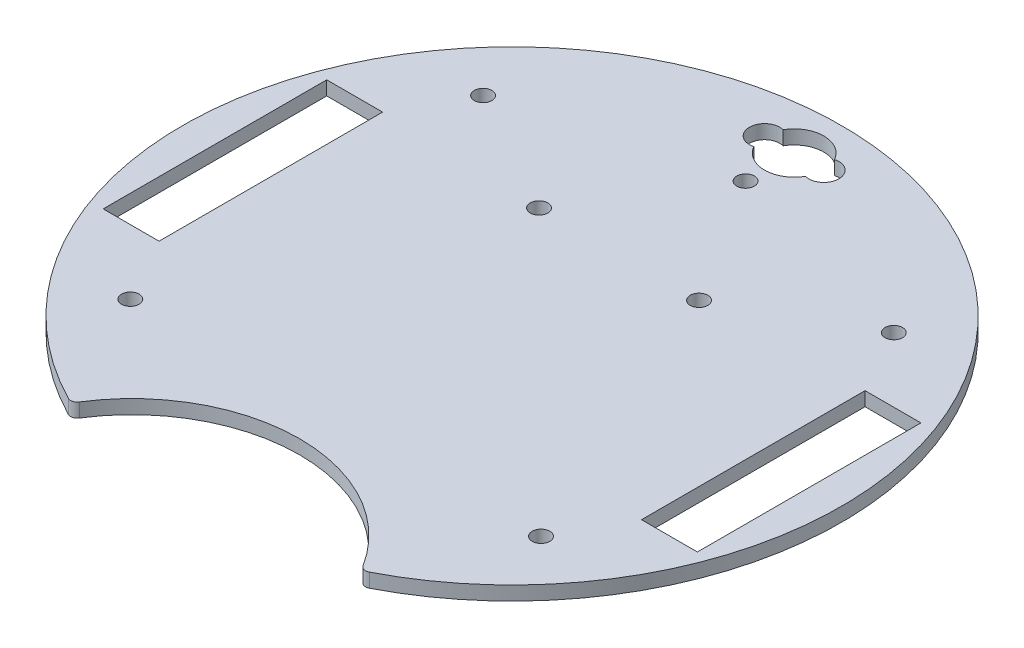
ISO-10303-21;
HEADER;
FILE_DESCRIPTION(('STEP AP214'),'2;1');
FILE_NAME('part.step','',(''),(''),'','','');
FILE_SCHEMA(('AUTOMOTIVE_DESIGN { 1 0 10303 214 1 1 1 1 }'));
ENDSEC;
DATA;
#1=APPLICATION_CONTEXT('core data for automotive mechanical design processes');
#2=APPLICATION_PROTOCOL_DEFINITION('international standard','automotive_design',2000,#1);
#3=PRODUCT_CONTEXT('',#1,'mechanical');
#4=PRODUCT('Part','Part','',(#3));
#5=PRODUCT_RELATED_PRODUCT_CATEGORY('part','',(#4));
#6=PRODUCT_DEFINITION_FORMATION('','',#4);
#7=PRODUCT_DEFINITION_CONTEXT('part definition',#1,'design');
#8=PRODUCT_DEFINITION('design','',#6,#7);
#9=PRODUCT_DEFINITION_SHAPE('','',#8);
#10=(LENGTH_UNIT() NAMED_UNIT(*) SI_UNIT(.MILLI.,.METRE.));
#11=(NAMED_UNIT(*) PLANE_ANGLE_UNIT() SI_UNIT($,.RADIAN.));
#12=(NAMED_UNIT(*) SI_UNIT($,.STERADIAN.) SOLID_ANGLE_UNIT());
#13=UNCERTAINTY_MEASURE_WITH_UNIT(LENGTH_MEASURE(1.E-05),#10,'distance_accuracy_value','');
#14=(GEOMETRIC_REPRESENTATION_CONTEXT(3) GLOBAL_UNCERTAINTY_ASSIGNED_CONTEXT((#13)) GLOBAL_UNIT_ASSIGNED_CONTEXT((#10,
#11,#12)) REPRESENTATION_CONTEXT('',''));
#15=CARTESIAN_POINT('',(0.,0.,0.));
#16=DIRECTION('',(0.,0.,1.));
#17=DIRECTION('',(1.,0.,0.));
#18=AXIS2_PLACEMENT_3D('',#15,#16,#17);
#19=CARTESIAN_POINT('',(0.,3.175,-64.1076988434385));
#20=DIRECTION('',(0.,-1.,0.));
#21=DIRECTION('',(0.,0.,-1.));
#22=AXIS2_PLACEMENT_3D('',#19,#20,#21);
#23=CYLINDRICAL_SURFACE('',#22,6.731);
#24=CARTESIAN_POINT('',(0.,0.,-64.1076988434385));
#25=DIRECTION('',(0.,1.,0.));
#26=DIRECTION('',(0.,0.,1.));
#27=AXIS2_PLACEMENT_3D('',#24,#25,#26);
#28=CIRCLE('',#27,6.731);
#29=CARTESIAN_POINT('',(-5.85389998799957,0.,-60.7853177800295));
#30=VERTEX_POINT('',#29);
#31=CARTESIAN_POINT('',(5.85757547169812,0.,-60.7918021934567));
#32=VERTEX_POINT('',#31);
#33=EDGE_CURVE('E235',#30,#32,#28,.T.);
#34=ORIENTED_EDGE('',*,*,#33,.F.);
#35=DIRECTION('',(0.,-1.,0.));
#36=VECTOR('',#35,1.);
#37=CARTESIAN_POINT('',(-5.85389998799957,3.175,-60.7853177800295));
#38=LINE('',#37,#36);
#39=CARTESIAN_POINT('',(-5.85389998799957,3.175,-60.7853177800295));
#40=VERTEX_POINT('',#39);
#41=EDGE_CURVE('E11',#40,#30,#38,.T.);
#42=ORIENTED_EDGE('',*,*,#41,.F.);
#43=CARTESIAN_POINT('',(0.,3.175,-64.1076988434385));
#44=DIRECTION('',(0.,1.,0.));
#45=DIRECTION('',(0.,0.,1.));
#46=AXIS2_PLACEMENT_3D('',#43,#44,#45);
#47=CIRCLE('',#46,6.731);
#48=CARTESIAN_POINT('',(5.85757547169812,3.175,-60.7918021934567));
#49=VERTEX_POINT('',#48);
#50=EDGE_CURVE('E170',#40,#49,#47,.T.);
#51=ORIENTED_EDGE('',*,*,#50,.T.);
#52=DIRECTION('',(0.,-1.,0.));
#53=VECTOR('',#52,1.);
#54=CARTESIAN_POINT('',(5.85757547169812,3.175,-60.7918021934567));
#55=LINE('',#54,#53);
#56=EDGE_CURVE('E53',#49,#32,#55,.T.);
#57=ORIENTED_EDGE('',*,*,#56,.T.);
#58=EDGE_LOOP('',(#34,#42,#51,#57));
#59=FACE_BOUND('',#58,.T.);
#60=ADVANCED_FACE('F34',(#59),#23,.F.);
#61=CARTESIAN_POINT('',(-6.731,3.175,-64.1076988434385));
#62=DIRECTION('',(0.,-1.,0.));
#63=DIRECTION('',(0.,0.,-1.));
#64=AXIS2_PLACEMENT_3D('',#61,#62,#63);
#65=CYLINDRICAL_SURFACE('',#64,3.43620726405579);
#66=CARTESIAN_POINT('',(-6.731,0.,-64.1076988434385));
#67=DIRECTION('',(0.,1.,0.));
#68=DIRECTION('',(0.,0.,1.));
#69=AXIS2_PLACEMENT_3D('',#66,#67,#68);
#70=CIRCLE('',#69,3.43620726405579);
#71=CARTESIAN_POINT('',(-5.85389998799957,0.,-67.4300799068475));
#72=VERTEX_POINT('',#71);
#73=EDGE_CURVE('E158',#72,#30,#70,.T.);
#74=ORIENTED_EDGE('',*,*,#73,.F.);
#75=DIRECTION('',(0.,-1.,0.));
#76=VECTOR('',#75,1.);
#77=CARTESIAN_POINT('',(-5.85389998799957,3.175,-67.4300799068475));
#78=LINE('',#77,#76);
#79=CARTESIAN_POINT('',(-5.85389998799957,3.175,-67.4300799068475));
#80=VERTEX_POINT('',#79);
#81=EDGE_CURVE('E44',#80,#72,#78,.T.);
#82=ORIENTED_EDGE('',*,*,#81,.F.);
#83=CARTESIAN_POINT('',(-6.731,3.175,-64.1076988434385));
#84=DIRECTION('',(0.,1.,0.));
#85=DIRECTION('',(0.,0.,1.));
#86=AXIS2_PLACEMENT_3D('',#83,#84,#85);
#87=CIRCLE('',#86,3.43620726405579);
#88=EDGE_CURVE('E156',#80,#40,#87,.T.);
#89=ORIENTED_EDGE('',*,*,#88,.T.);
#90=ORIENTED_EDGE('',*,*,#41,.T.);
#91=EDGE_LOOP('',(#74,#82,#89,#90));
#92=FACE_BOUND('',#91,.T.);
#93=ADVANCED_FACE('F155',(#92),#65,.F.);
#94=CARTESIAN_POINT('',(0.,3.175,-64.1076988434385));
#95=DIRECTION('',(0.,-1.,0.));
#96=DIRECTION('',(0.,0.,-1.));
#97=AXIS2_PLACEMENT_3D('',#94,#95,#96);
#98=CYLINDRICAL_SURFACE('',#97,6.731);
#99=CARTESIAN_POINT('',(0.,0.,-64.1076988434385));
#100=DIRECTION('',(0.,1.,0.));
#101=DIRECTION('',(0.,0.,1.));
#102=AXIS2_PLACEMENT_3D('',#99,#100,#101);
#103=CIRCLE('',#102,6.731);
#104=CARTESIAN_POINT('',(5.8575754716981,0.,-67.4235954934203));
#105=VERTEX_POINT('',#104);
#106=EDGE_CURVE('E238',#105,#72,#103,.T.);
#107=ORIENTED_EDGE('',*,*,#106,.F.);
#108=DIRECTION('',(0.,-1.,0.));
#109=VECTOR('',#108,1.);
#110=CARTESIAN_POINT('',(5.8575754716981,3.175,-67.4235954934203));
#111=LINE('',#110,#109);
#112=CARTESIAN_POINT('',(5.8575754716981,3.175,-67.4235954934203));
#113=VERTEX_POINT('',#112);
#114=EDGE_CURVE('E102',#113,#105,#111,.T.);
#115=ORIENTED_EDGE('',*,*,#114,.F.);
#116=CARTESIAN_POINT('',(0.,3.175,-64.1076988434385));
#117=DIRECTION('',(0.,1.,0.));
#118=DIRECTION('',(0.,0.,1.));
#119=AXIS2_PLACEMENT_3D('',#116,#117,#118);
#120=CIRCLE('',#119,6.731);
#121=EDGE_CURVE('E169',#113,#80,#120,.T.);
#122=ORIENTED_EDGE('',*,*,#121,.T.);
#123=ORIENTED_EDGE('',*,*,#81,.T.);
#124=EDGE_LOOP('',(#107,#115,#122,#123));
#125=FACE_BOUND('',#124,.T.);
#126=ADVANCED_FACE('F172',(#125),#98,.F.);
#127=CARTESIAN_POINT('',(0.,3.175,-25.4000000000001));
#128=DIRECTION('',(0.,0.,-1.));
#129=DIRECTION('',(-1.,0.,0.));
#130=AXIS2_PLACEMENT_3D('',#127,#128,#129);
#131=PLANE('',#130);
#132=DIRECTION('',(1.,0.,0.));
#133=VECTOR('',#132,1.);
#134=CARTESIAN_POINT('',(0.,0.,-25.4000000000001));
#135=LINE('',#134,#133);
#136=CARTESIAN_POINT('',(-67.5141237268841,0.,-25.4000000000001));
#137=VERTEX_POINT('',#136);
#138=CARTESIAN_POINT('',(-54.8141237268841,0.,-25.4000000000001));
#139=VERTEX_POINT('',#138);
#140=EDGE_CURVE('E224',#137,#139,#135,.T.);
#141=ORIENTED_EDGE('',*,*,#140,.T.);
#142=DIRECTION('',(0.,-1.,0.));
#143=VECTOR('',#142,1.);
#144=CARTESIAN_POINT('',(-54.8141237268841,3.175,-25.4000000000001));
#145=LINE('',#144,#143);
#146=CARTESIAN_POINT('',(-54.8141237268841,3.175,-25.4000000000001));
#147=VERTEX_POINT('',#146);
#148=EDGE_CURVE('E251',#147,#139,#145,.T.);
#149=ORIENTED_EDGE('',*,*,#148,.F.);
#150=DIRECTION('',(1.,0.,0.));
#151=VECTOR('',#150,1.);
#152=CARTESIAN_POINT('',(0.,3.175,-25.4000000000001));
#153=LINE('',#152,#151);
#154=CARTESIAN_POINT('',(-67.5141237268841,3.175,-25.4000000000001));
#155=VERTEX_POINT('',#154);
#156=EDGE_CURVE('E559',#155,#147,#153,.T.);
#157=ORIENTED_EDGE('',*,*,#156,.F.);
#158=DIRECTION('',(0.,-1.,0.));
#159=VECTOR('',#158,1.);
#160=CARTESIAN_POINT('',(-67.5141237268841,3.175,-25.4000000000001));
#161=LINE('',#160,#159);
#162=EDGE_CURVE('E253',#155,#137,#161,.T.);
#163=ORIENTED_EDGE('',*,*,#162,.T.);
#164=EDGE_LOOP('',(#141,#149,#157,#163));
#165=FACE_BOUND('',#164,.T.);
#166=ADVANCED_FACE('F329',(#165),#131,.F.);
#167=CARTESIAN_POINT('',(-54.8141237268841,3.175,0.));
#168=DIRECTION('',(1.,0.,0.));
#169=DIRECTION('',(0.,0.,-1.));
#170=AXIS2_PLACEMENT_3D('',#167,#168,#169);
#171=PLANE('',#170);
#172=DIRECTION('',(0.,0.,1.));
#173=VECTOR('',#172,1.);
#174=CARTESIAN_POINT('',(-54.8141237268841,0.,0.));
#175=LINE('',#174,#173);
#176=CARTESIAN_POINT('',(-54.8141237268841,0.,25.3999999999999));
#177=VERTEX_POINT('',#176);
#178=EDGE_CURVE('E227',#139,#177,#175,.T.);
#179=ORIENTED_EDGE('',*,*,#178,.T.);
#180=DIRECTION('',(0.,-1.,0.));
#181=VECTOR('',#180,1.);
#182=CARTESIAN_POINT('',(-54.8141237268841,3.175,25.3999999999999));
#183=LINE('',#182,#181);
#184=CARTESIAN_POINT('',(-54.8141237268841,3.175,25.3999999999999));
#185=VERTEX_POINT('',#184);
#186=EDGE_CURVE('E259',#185,#177,#183,.T.);
#187=ORIENTED_EDGE('',*,*,#186,.F.);
#188=DIRECTION('',(0.,0.,1.));
#189=VECTOR('',#188,1.);
#190=CARTESIAN_POINT('',(-54.8141237268841,3.175,0.));
#191=LINE('',#190,#189);
#192=EDGE_CURVE('E562',#147,#185,#191,.T.);
#193=ORIENTED_EDGE('',*,*,#192,.F.);
#194=ORIENTED_EDGE('',*,*,#148,.T.);
#195=EDGE_LOOP('',(#179,#187,#193,#194));
#196=FACE_BOUND('',#195,.T.);
#197=ADVANCED_FACE('F325',(#196),#171,.F.);
#198=CARTESIAN_POINT('',(0.,3.175,25.3999999999999));
#199=DIRECTION('',(0.,0.,-1.));
#200=DIRECTION('',(-1.,0.,0.));
#201=AXIS2_PLACEMENT_3D('',#198,#199,#200);
#202=PLANE('',#201);
#203=DIRECTION('',(1.,0.,0.));
#204=VECTOR('',#203,1.);
#205=CARTESIAN_POINT('',(0.,0.,25.3999999999999));
#206=LINE('',#205,#204);
#207=CARTESIAN_POINT('',(-67.5141237268841,0.,25.3999999999999));
#208=VERTEX_POINT('',#207);
#209=EDGE_CURVE('E230',#208,#177,#206,.T.);
#210=ORIENTED_EDGE('',*,*,#209,.F.);
#211=DIRECTION('',(0.,-1.,0.));
#212=VECTOR('',#211,1.);
#213=CARTESIAN_POINT('',(-67.5141237268841,3.175,25.3999999999999));
#214=LINE('',#213,#212);
#215=CARTESIAN_POINT('',(-67.5141237268841,3.175,25.3999999999999));
#216=VERTEX_POINT('',#215);
#217=EDGE_CURVE('E256',#216,#208,#214,.T.);
#218=ORIENTED_EDGE('',*,*,#217,.F.);
#219=DIRECTION('',(1.,0.,0.));
#220=VECTOR('',#219,1.);
#221=CARTESIAN_POINT('',(0.,3.175,25.3999999999999));
#222=LINE('',#221,#220);
#223=EDGE_CURVE('E571',#216,#185,#222,.T.);
#224=ORIENTED_EDGE('',*,*,#223,.T.);
#225=ORIENTED_EDGE('',*,*,#186,.T.);
#226=EDGE_LOOP('',(#210,#218,#224,#225));
#227=FACE_BOUND('',#226,.T.);
#228=ADVANCED_FACE('F321',(#227),#202,.T.);
#229=CARTESIAN_POINT('',(67.5141237268841,3.175,0.));
#230=DIRECTION('',(-1.,0.,0.));
#231=DIRECTION('',(0.,0.,1.));
#232=AXIS2_PLACEMENT_3D('',#229,#230,#231);
#233=PLANE('',#232);
#234=DIRECTION('',(0.,0.,-1.));
#235=VECTOR('',#234,1.);
#236=CARTESIAN_POINT('',(67.5141237268841,0.,0.));
#237=LINE('',#236,#235);
#238=CARTESIAN_POINT('',(67.5141237268841,0.,25.3999999999999));
#239=VERTEX_POINT('',#238);
#240=CARTESIAN_POINT('',(67.5141237268841,0.,-25.4000000000001));
#241=VERTEX_POINT('',#240);
#242=EDGE_CURVE('E212',#239,#241,#237,.T.);
#243=ORIENTED_EDGE('',*,*,#242,.F.);
#244=DIRECTION('',(0.,-1.,0.));
#245=VECTOR('',#244,1.);
#246=CARTESIAN_POINT('',(67.5141237268841,3.175,25.3999999999999));
#247=LINE('',#246,#245);
#248=CARTESIAN_POINT('',(67.5141237268841,3.175,25.3999999999999));
#249=VERTEX_POINT('',#248);
#250=EDGE_CURVE('E257',#249,#239,#247,.T.);
#251=ORIENTED_EDGE('',*,*,#250,.F.);
#252=DIRECTION('',(0.,0.,-1.));
#253=VECTOR('',#252,1.);
#254=CARTESIAN_POINT('',(67.5141237268841,3.175,0.));
#255=LINE('',#254,#253);
#256=CARTESIAN_POINT('',(67.5141237268841,3.175,-25.4000000000001));
#257=VERTEX_POINT('',#256);
#258=EDGE_CURVE('E556',#249,#257,#255,.T.);
#259=ORIENTED_EDGE('',*,*,#258,.T.);
#260=DIRECTION('',(0.,-1.,0.));
#261=VECTOR('',#260,1.);
#262=CARTESIAN_POINT('',(67.5141237268841,3.175,-25.4000000000001));
#263=LINE('',#262,#261);
#264=EDGE_CURVE('E263',#257,#241,#263,.T.);
#265=ORIENTED_EDGE('',*,*,#264,.T.);
#266=EDGE_LOOP('',(#243,#251,#259,#265));
#267=FACE_BOUND('',#266,.T.);
#268=ADVANCED_FACE('F324',(#267),#233,.T.);
#269=CARTESIAN_POINT('',(0.,3.175,25.3999999999999));
#270=DIRECTION('',(0.,0.,1.));
#271=DIRECTION('',(1.,0.,0.));
#272=AXIS2_PLACEMENT_3D('',#269,#270,#271);
#273=PLANE('',#272);
#274=DIRECTION('',(-1.,0.,0.));
#275=VECTOR('',#274,1.);
#276=CARTESIAN_POINT('',(0.,0.,25.3999999999999));
#277=LINE('',#276,#275);
#278=CARTESIAN_POINT('',(54.8141237268841,0.,25.3999999999999));
#279=VERTEX_POINT('',#278);
#280=EDGE_CURVE('E215',#239,#279,#277,.T.);
#281=ORIENTED_EDGE('',*,*,#280,.T.);
#282=DIRECTION('',(0.,-1.,0.));
#283=VECTOR('',#282,1.);
#284=CARTESIAN_POINT('',(54.8141237268841,3.175,25.3999999999999));
#285=LINE('',#284,#283);
#286=CARTESIAN_POINT('',(54.8141237268841,3.175,25.3999999999999));
#287=VERTEX_POINT('',#286);
#288=EDGE_CURVE('E267',#287,#279,#285,.T.);
#289=ORIENTED_EDGE('',*,*,#288,.F.);
#290=DIRECTION('',(-1.,0.,0.));
#291=VECTOR('',#290,1.);
#292=CARTESIAN_POINT('',(0.,3.175,25.3999999999999));
#293=LINE('',#292,#291);
#294=EDGE_CURVE('E587',#249,#287,#293,.T.);
#295=ORIENTED_EDGE('',*,*,#294,.F.);
#296=ORIENTED_EDGE('',*,*,#250,.T.);
#297=EDGE_LOOP('',(#281,#289,#295,#296));
#298=FACE_BOUND('',#297,.T.);
#299=ADVANCED_FACE('F341',(#298),#273,.F.);
#300=CARTESIAN_POINT('',(54.8141237268841,3.175,0.));
#301=DIRECTION('',(-1.,0.,0.));
#302=DIRECTION('',(0.,0.,1.));
#303=AXIS2_PLACEMENT_3D('',#300,#301,#302);
#304=PLANE('',#303);
#305=DIRECTION('',(0.,0.,-1.));
#306=VECTOR('',#305,1.);
#307=CARTESIAN_POINT('',(54.8141237268841,0.,0.));
#308=LINE('',#307,#306);
#309=CARTESIAN_POINT('',(54.8141237268841,0.,-25.4000000000001));
#310=VERTEX_POINT('',#309);
#311=EDGE_CURVE('E218',#279,#310,#308,.T.);
#312=ORIENTED_EDGE('',*,*,#311,.T.);
#313=DIRECTION('',(0.,-1.,0.));
#314=VECTOR('',#313,1.);
#315=CARTESIAN_POINT('',(54.8141237268841,3.175,-25.4000000000001));
#316=LINE('',#315,#314);
#317=CARTESIAN_POINT('',(54.8141237268841,3.175,-25.4000000000001));
#318=VERTEX_POINT('',#317);
#319=EDGE_CURVE('E265',#318,#310,#316,.T.);
#320=ORIENTED_EDGE('',*,*,#319,.F.);
#321=DIRECTION('',(0.,0.,-1.));
#322=VECTOR('',#321,1.);
#323=CARTESIAN_POINT('',(54.8141237268841,3.175,0.));
#324=LINE('',#323,#322);
#325=EDGE_CURVE('E585',#287,#318,#324,.T.);
#326=ORIENTED_EDGE('',*,*,#325,.F.);
#327=ORIENTED_EDGE('',*,*,#288,.T.);
#328=EDGE_LOOP('',(#312,#320,#326,#327));
#329=FACE_BOUND('',#328,.T.);
#330=ADVANCED_FACE('F338',(#329),#304,.F.);
#331=CARTESIAN_POINT('',(33.5100001196225,3.175,65.3012960955778));
#332=DIRECTION('',(0.,-1.,0.));
#333=DIRECTION('',(0.,0.,-1.));
#334=AXIS2_PLACEMENT_3D('',#331,#332,#333);
#335=CYLINDRICAL_SURFACE('',#334,1.50000000000011);
#336=CARTESIAN_POINT('',(33.5100001196225,0.,65.3012960955778));
#337=DIRECTION('',(0.,1.,0.));
#338=DIRECTION('',(0.,0.,1.));
#339=AXIS2_PLACEMENT_3D('',#336,#337,#338);
#340=CIRCLE('',#339,1.50000000000011);
#341=CARTESIAN_POINT('',(34.1948335778492,0.,66.6358383895849));
#342=VERTEX_POINT('',#341);
#343=CARTESIAN_POINT('',(32.2406819332729,0.,66.100565350462));
#344=VERTEX_POINT('',#343);
#345=EDGE_CURVE('E191',#342,#344,#340,.F.);
#346=ORIENTED_EDGE('',*,*,#345,.F.);
#347=DIRECTION('',(0.,-1.,0.));
#348=VECTOR('',#347,1.);
#349=CARTESIAN_POINT('',(34.1948335778492,3.175,66.6358383895849));
#350=LINE('',#349,#348);
#351=CARTESIAN_POINT('',(34.1948335778492,3.175,66.6358383895849));
#352=VERTEX_POINT('',#351);
#353=EDGE_CURVE('E38',#352,#342,#350,.T.);
#354=ORIENTED_EDGE('',*,*,#353,.F.);
#355=CARTESIAN_POINT('',(33.5100001196225,3.175,65.3012960955778));
#356=DIRECTION('',(0.,1.,0.));
#357=DIRECTION('',(0.,0.,1.));
#358=AXIS2_PLACEMENT_3D('',#355,#356,#357);
#359=CIRCLE('',#358,1.50000000000011);
#360=CARTESIAN_POINT('',(32.2406819332729,3.175,66.100565350462));
#361=VERTEX_POINT('',#360);
#362=EDGE_CURVE('E288',#352,#361,#359,.F.);
#363=ORIENTED_EDGE('',*,*,#362,.T.);
#364=DIRECTION('',(0.,-1.,0.));
#365=VECTOR('',#364,1.);
#366=CARTESIAN_POINT('',(32.2406819332729,3.175,66.100565350462));
#367=LINE('',#366,#365);
#368=EDGE_CURVE('E184',#361,#344,#367,.T.);
#369=ORIENTED_EDGE('',*,*,#368,.T.);
#370=EDGE_LOOP('',(#346,#354,#363,#369));
#371=FACE_BOUND('',#370,.T.);
#372=ADVANCED_FACE('F287',(#371),#335,.T.);
#373=CARTESIAN_POINT('',(0.,3.175,0.));
#374=DIRECTION('',(0.,-1.,0.));
#375=DIRECTION('',(0.,0.,-1.));
#376=AXIS2_PLACEMENT_3D('',#373,#374,#375);
#377=CYLINDRICAL_SURFACE('',#376,74.8974071734108);
#378=CARTESIAN_POINT('',(0.,0.,0.));
#379=DIRECTION('',(0.,1.,0.));
#380=DIRECTION('',(0.,0.,1.));
#381=AXIS2_PLACEMENT_3D('',#378,#379,#380);
#382=CIRCLE('',#381,74.8974071734108);
#383=CARTESIAN_POINT('',(-34.1948335778492,0.,66.6358383895849));
#384=VERTEX_POINT('',#383);
#385=EDGE_CURVE('E194',#342,#384,#382,.T.);
#386=ORIENTED_EDGE('',*,*,#385,.T.);
#387=DIRECTION('',(0.,-1.,0.));
#388=VECTOR('',#387,1.);
#389=CARTESIAN_POINT('',(-34.1948335778492,3.175,66.6358383895849));
#390=LINE('',#389,#388);
#391=CARTESIAN_POINT('',(-34.1948335778492,3.175,66.6358383895849));
#392=VERTEX_POINT('',#391);
#393=EDGE_CURVE('E273',#392,#384,#390,.T.);
#394=ORIENTED_EDGE('',*,*,#393,.F.);
#395=CARTESIAN_POINT('',(0.,3.175,0.));
#396=DIRECTION('',(0.,1.,0.));
#397=DIRECTION('',(0.,0.,1.));
#398=AXIS2_PLACEMENT_3D('',#395,#396,#397);
#399=CIRCLE('',#398,74.8974071734108);
#400=EDGE_CURVE('E281',#352,#392,#399,.T.);
#401=ORIENTED_EDGE('',*,*,#400,.F.);
#402=ORIENTED_EDGE('',*,*,#353,.T.);
#403=EDGE_LOOP('',(#386,#394,#401,#402));
#404=FACE_BOUND('',#403,.T.);
#405=ADVANCED_FACE('F279',(#404),#377,.T.);
#406=CARTESIAN_POINT('',(-33.5100001196225,3.175,65.3012960955779));
#407=DIRECTION('',(0.,-1.,0.));
#408=DIRECTION('',(0.,0.,-1.));
#409=AXIS2_PLACEMENT_3D('',#406,#407,#408);
#410=CYLINDRICAL_SURFACE('',#409,1.50000000000026);
#411=CARTESIAN_POINT('',(-33.5100001196225,0.,65.3012960955779));
#412=DIRECTION('',(0.,1.,0.));
#413=DIRECTION('',(0.,0.,1.));
#414=AXIS2_PLACEMENT_3D('',#411,#412,#413);
#415=CIRCLE('',#414,1.50000000000026);
#416=CARTESIAN_POINT('',(-32.2406819332729,0.,66.100565350462));
#417=VERTEX_POINT('',#416);
#418=EDGE_CURVE('E197',#384,#417,#415,.T.);
#419=ORIENTED_EDGE('',*,*,#418,.T.);
#420=DIRECTION('',(0.,-1.,0.));
#421=VECTOR('',#420,1.);
#422=CARTESIAN_POINT('',(-32.2406819332729,3.175,66.100565350462));
#423=LINE('',#422,#421);
#424=CARTESIAN_POINT('',(-32.2406819332729,3.175,66.100565350462));
#425=VERTEX_POINT('',#424);
#426=EDGE_CURVE('E272',#425,#417,#423,.T.);
#427=ORIENTED_EDGE('',*,*,#426,.F.);
#428=CARTESIAN_POINT('',(-33.5100001196225,3.175,65.3012960955779));
#429=DIRECTION('',(0.,1.,0.));
#430=DIRECTION('',(0.,0.,1.));
#431=AXIS2_PLACEMENT_3D('',#428,#429,#430);
#432=CIRCLE('',#431,1.50000000000026);
#433=EDGE_CURVE('E594',#392,#425,#432,.T.);
#434=ORIENTED_EDGE('',*,*,#433,.F.);
#435=ORIENTED_EDGE('',*,*,#393,.T.);
#436=EDGE_LOOP('',(#419,#427,#434,#435));
#437=FACE_BOUND('',#436,.T.);
#438=ADVANCED_FACE('F295',(#437),#410,.T.);
#439=CARTESIAN_POINT('',(-18.1789527954067,3.175,-24.3105510962522));
#440=DIRECTION('',(0.,-1.,0.));
#441=DIRECTION('',(0.,0.,-1.));
#442=AXIS2_PLACEMENT_3D('',#439,#440,#441);
#443=CYLINDRICAL_SURFACE('',#442,2.);
#444=CARTESIAN_POINT('',(-18.1789527954067,3.175,-24.3105510962522));
#445=DIRECTION('',(0.,1.,0.));
#446=DIRECTION('',(0.,0.,1.));
#447=AXIS2_PLACEMENT_3D('',#444,#445,#446);
#448=CIRCLE('',#447,2.);
#449=CARTESIAN_POINT('',(-18.1789527954067,3.175,-22.3105510962522));
#450=VERTEX_POINT('',#449);
#451=EDGE_CURVE('E175',#450,#450,#448,.F.);
#452=ORIENTED_EDGE('',*,*,#451,.F.);
#453=EDGE_LOOP('',(#452));
#454=FACE_BOUND('',#453,.T.);
#455=CARTESIAN_POINT('',(-18.1789527954067,0.,-24.3105510962522));
#456=DIRECTION('',(0.,1.,0.));
#457=DIRECTION('',(0.,0.,1.));
#458=AXIS2_PLACEMENT_3D('',#455,#456,#457);
#459=CIRCLE('',#458,2.);
#460=CARTESIAN_POINT('',(-18.1789527954067,0.,-22.3105510962522));
#461=VERTEX_POINT('',#460);
#462=EDGE_CURVE('E243',#461,#461,#459,.F.);
#463=ORIENTED_EDGE('',*,*,#462,.T.);
#464=EDGE_LOOP('',(#463));
#465=FACE_BOUND('',#464,.T.);
#466=ADVANCED_FACE('F297',(#454,#465),#443,.F.);
#467=CARTESIAN_POINT('',(6.731,3.175,-64.1076988434385));
#468=DIRECTION('',(0.,-1.,0.));
#469=DIRECTION('',(0.,0.,-1.));
#470=AXIS2_PLACEMENT_3D('',#467,#468,#469);
#471=CYLINDRICAL_SURFACE('',#470,3.429);
#472=CARTESIAN_POINT('',(6.731,0.,-64.1076988434385));
#473=DIRECTION('',(0.,1.,0.));
#474=DIRECTION('',(0.,0.,1.));
#475=AXIS2_PLACEMENT_3D('',#472,#473,#474);
#476=CIRCLE('',#475,3.429);
#477=EDGE_CURVE('E240',#32,#105,#476,.T.);
#478=ORIENTED_EDGE('',*,*,#477,.F.);
#479=ORIENTED_EDGE('',*,*,#56,.F.);
#480=CARTESIAN_POINT('',(6.731,3.175,-64.1076988434385));
#481=DIRECTION('',(0.,1.,0.));
#482=DIRECTION('',(0.,0.,1.));
#483=AXIS2_PLACEMENT_3D('',#480,#481,#482);
#484=CIRCLE('',#483,3.429);
#485=EDGE_CURVE('E173',#49,#113,#484,.T.);
#486=ORIENTED_EDGE('',*,*,#485,.T.);
#487=ORIENTED_EDGE('',*,*,#114,.T.);
#488=EDGE_LOOP('',(#478,#479,#486,#487));
#489=FACE_BOUND('',#488,.T.);
#490=ADVANCED_FACE('F303',(#489),#471,.F.);
#491=CARTESIAN_POINT('',(-67.5141237268841,3.175,0.));
#492=DIRECTION('',(-1.,0.,0.));
#493=DIRECTION('',(0.,0.,1.));
#494=AXIS2_PLACEMENT_3D('',#491,#492,#493);
#495=PLANE('',#494);
#496=DIRECTION('',(0.,0.,-1.));
#497=VECTOR('',#496,1.);
#498=CARTESIAN_POINT('',(-67.5141237268841,0.,0.));
#499=LINE('',#498,#497);
#500=EDGE_CURVE('E233',#208,#137,#499,.T.);
#501=ORIENTED_EDGE('',*,*,#500,.T.);
#502=ORIENTED_EDGE('',*,*,#162,.F.);
#503=DIRECTION('',(0.,0.,-1.));
#504=VECTOR('',#503,1.);
#505=CARTESIAN_POINT('',(-67.5141237268841,3.175,0.));
#506=LINE('',#505,#504);
#507=EDGE_CURVE('E565',#216,#155,#506,.T.);
#508=ORIENTED_EDGE('',*,*,#507,.F.);
#509=ORIENTED_EDGE('',*,*,#217,.T.);
#510=EDGE_LOOP('',(#501,#502,#508,#509));
#511=FACE_BOUND('',#510,.T.);
#512=ADVANCED_FACE('F316',(#511),#495,.F.);
#513=CARTESIAN_POINT('',(0.,3.175,-25.4000000000001));
#514=DIRECTION('',(0.,0.,1.));
#515=DIRECTION('',(1.,0.,0.));
#516=AXIS2_PLACEMENT_3D('',#513,#514,#515);
#517=PLANE('',#516);
#518=DIRECTION('',(-1.,0.,0.));
#519=VECTOR('',#518,1.);
#520=CARTESIAN_POINT('',(0.,0.,-25.4000000000001));
#521=LINE('',#520,#519);
#522=EDGE_CURVE('E221',#241,#310,#521,.T.);
#523=ORIENTED_EDGE('',*,*,#522,.F.);
#524=ORIENTED_EDGE('',*,*,#264,.F.);
#525=DIRECTION('',(-1.,0.,0.));
#526=VECTOR('',#525,1.);
#527=CARTESIAN_POINT('',(0.,3.175,-25.4000000000001));
#528=LINE('',#527,#526);
#529=EDGE_CURVE('E567',#257,#318,#528,.T.);
#530=ORIENTED_EDGE('',*,*,#529,.T.);
#531=ORIENTED_EDGE('',*,*,#319,.T.);
#532=EDGE_LOOP('',(#523,#524,#530,#531));
#533=FACE_BOUND('',#532,.T.);
#534=ADVANCED_FACE('F319',(#533),#517,.T.);
#535=CARTESIAN_POINT('',(-46.6637339832601,3.175,40.0812318826666));
#536=DIRECTION('',(0.,-1.,0.));
#537=DIRECTION('',(0.,0.,-1.));
#538=AXIS2_PLACEMENT_3D('',#535,#536,#537);
#539=CYLINDRICAL_SURFACE('',#538,2.);
#540=CARTESIAN_POINT('',(-46.6637339832601,3.175,40.0812318826666));
#541=DIRECTION('',(0.,1.,0.));
#542=DIRECTION('',(0.,0.,1.));
#543=AXIS2_PLACEMENT_3D('',#540,#541,#542);
#544=CIRCLE('',#543,2.);
#545=CARTESIAN_POINT('',(-46.6637339832601,3.175,42.0812318826666));
#546=VERTEX_POINT('',#545);
#547=EDGE_CURVE('E550',#546,#546,#544,.T.);
#548=ORIENTED_EDGE('',*,*,#547,.T.);
#549=EDGE_LOOP('',(#548));
#550=FACE_BOUND('',#549,.T.);
#551=CARTESIAN_POINT('',(-46.6637339832601,0.,40.0812318826666));
#552=DIRECTION('',(0.,1.,0.));
#553=DIRECTION('',(0.,0.,1.));
#554=AXIS2_PLACEMENT_3D('',#551,#552,#553);
#555=CIRCLE('',#554,2.);
#556=CARTESIAN_POINT('',(-46.6637339832601,0.,42.0812318826666));
#557=VERTEX_POINT('',#556);
#558=EDGE_CURVE('E209',#557,#557,#555,.T.);
#559=ORIENTED_EDGE('',*,*,#558,.F.);
#560=EDGE_LOOP('',(#559));
#561=FACE_BOUND('',#560,.T.);
#562=ADVANCED_FACE('F336',(#550,#561),#539,.F.);
#563=CARTESIAN_POINT('',(46.6637339832601,3.175,40.0812318826666));
#564=DIRECTION('',(0.,-1.,0.));
#565=DIRECTION('',(0.,0.,-1.));
#566=AXIS2_PLACEMENT_3D('',#563,#564,#565);
#567=CYLINDRICAL_SURFACE('',#566,2.);
#568=CARTESIAN_POINT('',(46.6637339832601,3.175,40.0812318826666));
#569=DIRECTION('',(0.,1.,0.));
#570=DIRECTION('',(0.,0.,1.));
#571=AXIS2_PLACEMENT_3D('',#568,#569,#570);
#572=CIRCLE('',#571,2.);
#573=CARTESIAN_POINT('',(46.6637339832601,3.175,42.0812318826666));
#574=VERTEX_POINT('',#573);
#575=EDGE_CURVE('E546',#574,#574,#572,.T.);
#576=ORIENTED_EDGE('',*,*,#575,.T.);
#577=EDGE_LOOP('',(#576));
#578=FACE_BOUND('',#577,.T.);
#579=CARTESIAN_POINT('',(46.6637339832601,0.,40.0812318826666));
#580=DIRECTION('',(0.,1.,0.));
#581=DIRECTION('',(0.,0.,1.));
#582=AXIS2_PLACEMENT_3D('',#579,#580,#581);
#583=CIRCLE('',#582,2.);
#584=CARTESIAN_POINT('',(46.6637339832601,0.,42.0812318826666));
#585=VERTEX_POINT('',#584);
#586=EDGE_CURVE('E206',#585,#585,#583,.T.);
#587=ORIENTED_EDGE('',*,*,#586,.F.);
#588=EDGE_LOOP('',(#587));
#589=FACE_BOUND('',#588,.T.);
#590=ADVANCED_FACE('F351',(#578,#589),#567,.F.);
#591=CARTESIAN_POINT('',(46.6637339832601,3.175,-40.0812318826666));
#592=DIRECTION('',(0.,-1.,0.));
#593=DIRECTION('',(0.,0.,-1.));
#594=AXIS2_PLACEMENT_3D('',#591,#592,#593);
#595=CYLINDRICAL_SURFACE('',#594,2.);
#596=CARTESIAN_POINT('',(46.6637339832601,3.175,-40.0812318826666));
#597=DIRECTION('',(0.,1.,0.));
#598=DIRECTION('',(0.,0.,1.));
#599=AXIS2_PLACEMENT_3D('',#596,#597,#598);
#600=CIRCLE('',#599,2.);
#601=CARTESIAN_POINT('',(46.6637339832601,3.175,-38.0812318826666));
#602=VERTEX_POINT('',#601);
#603=EDGE_CURVE('E542',#602,#602,#600,.F.);
#604=ORIENTED_EDGE('',*,*,#603,.F.);
#605=EDGE_LOOP('',(#604));
#606=FACE_BOUND('',#605,.T.);
#607=CARTESIAN_POINT('',(46.6637339832601,0.,-40.0812318826666));
#608=DIRECTION('',(0.,1.,0.));
#609=DIRECTION('',(0.,0.,1.));
#610=AXIS2_PLACEMENT_3D('',#607,#608,#609);
#611=CIRCLE('',#610,2.);
#612=CARTESIAN_POINT('',(46.6637339832601,0.,-38.0812318826666));
#613=VERTEX_POINT('',#612);
#614=EDGE_CURVE('E203',#613,#613,#611,.F.);
#615=ORIENTED_EDGE('',*,*,#614,.T.);
#616=EDGE_LOOP('',(#615));
#617=FACE_BOUND('',#616,.T.);
#618=ADVANCED_FACE('F355',(#606,#617),#595,.F.);
#619=CARTESIAN_POINT('',(0.,3.175,86.4020044245157));
#620=DIRECTION('',(0.,-1.,0.));
#621=DIRECTION('',(0.,0.,-1.));
#622=AXIS2_PLACEMENT_3D('',#619,#620,#621);
#623=CYLINDRICAL_SURFACE('',#622,38.0999999999998);
#624=CARTESIAN_POINT('',(0.,0.,86.4020044245157));
#625=DIRECTION('',(0.,1.,0.));
#626=DIRECTION('',(0.,0.,1.));
#627=AXIS2_PLACEMENT_3D('',#624,#625,#626);
#628=CIRCLE('',#627,38.0999999999998);
#629=EDGE_CURVE('E200',#344,#417,#628,.T.);
#630=ORIENTED_EDGE('',*,*,#629,.F.);
#631=ORIENTED_EDGE('',*,*,#368,.F.);
#632=CARTESIAN_POINT('',(0.,3.175,86.4020044245157));
#633=DIRECTION('',(0.,1.,0.));
#634=DIRECTION('',(0.,0.,1.));
#635=AXIS2_PLACEMENT_3D('',#632,#633,#634);
#636=CIRCLE('',#635,38.0999999999998);
#637=EDGE_CURVE('E293',#361,#425,#636,.T.);
#638=ORIENTED_EDGE('',*,*,#637,.T.);
#639=ORIENTED_EDGE('',*,*,#426,.T.);
#640=EDGE_LOOP('',(#630,#631,#638,#639));
#641=FACE_BOUND('',#640,.T.);
#642=ADVANCED_FACE('F292',(#641),#623,.F.);
#643=CARTESIAN_POINT('',(18.1789527954067,3.175,-24.3105510962522));
#644=DIRECTION('',(0.,-1.,0.));
#645=DIRECTION('',(0.,0.,-1.));
#646=AXIS2_PLACEMENT_3D('',#643,#644,#645);
#647=CYLINDRICAL_SURFACE('',#646,2.);
#648=CARTESIAN_POINT('',(18.1789527954067,3.175,-24.3105510962522));
#649=DIRECTION('',(0.,1.,0.));
#650=DIRECTION('',(0.,0.,1.));
#651=AXIS2_PLACEMENT_3D('',#648,#649,#650);
#652=CIRCLE('',#651,2.);
#653=CARTESIAN_POINT('',(18.1789527954067,3.175,-22.3105510962522));
#654=VERTEX_POINT('',#653);
#655=EDGE_CURVE('E537',#654,#654,#652,.T.);
#656=ORIENTED_EDGE('',*,*,#655,.T.);
#657=EDGE_LOOP('',(#656));
#658=FACE_BOUND('',#657,.T.);
#659=CARTESIAN_POINT('',(18.1789527954067,0.,-24.3105510962522));
#660=DIRECTION('',(0.,1.,0.));
#661=DIRECTION('',(0.,0.,1.));
#662=AXIS2_PLACEMENT_3D('',#659,#660,#661);
#663=CIRCLE('',#662,2.);
#664=CARTESIAN_POINT('',(18.1789527954067,0.,-22.3105510962522));
#665=VERTEX_POINT('',#664);
#666=EDGE_CURVE('E188',#665,#665,#663,.T.);
#667=ORIENTED_EDGE('',*,*,#666,.F.);
#668=EDGE_LOOP('',(#667));
#669=FACE_BOUND('',#668,.T.);
#670=ADVANCED_FACE('F360',(#658,#669),#647,.F.);
#671=CARTESIAN_POINT('',(0.,3.175,-53.0611879648997));
#672=DIRECTION('',(0.,-1.,0.));
#673=DIRECTION('',(0.,0.,-1.));
#674=AXIS2_PLACEMENT_3D('',#671,#672,#673);
#675=CYLINDRICAL_SURFACE('',#674,2.);
#676=CARTESIAN_POINT('',(0.,3.175,-53.0611879648997));
#677=DIRECTION('',(0.,1.,0.));
#678=DIRECTION('',(0.,0.,1.));
#679=AXIS2_PLACEMENT_3D('',#676,#677,#678);
#680=CIRCLE('',#679,2.);
#681=CARTESIAN_POINT('',(0.,3.175,-51.0611879648997));
#682=VERTEX_POINT('',#681);
#683=EDGE_CURVE('E249',#682,#682,#680,.T.);
#684=ORIENTED_EDGE('',*,*,#683,.T.);
#685=EDGE_LOOP('',(#684));
#686=FACE_BOUND('',#685,.T.);
#687=CARTESIAN_POINT('',(0.,0.,-53.0611879648997));
#688=DIRECTION('',(0.,1.,0.));
#689=DIRECTION('',(0.,0.,1.));
#690=AXIS2_PLACEMENT_3D('',#687,#688,#689);
#691=CIRCLE('',#690,2.);
#692=CARTESIAN_POINT('',(0.,0.,-51.0611879648997));
#693=VERTEX_POINT('',#692);
#694=EDGE_CURVE('E185',#693,#693,#691,.T.);
#695=ORIENTED_EDGE('',*,*,#694,.F.);
#696=EDGE_LOOP('',(#695));
#697=FACE_BOUND('',#696,.T.);
#698=ADVANCED_FACE('F36',(#686,#697),#675,.F.);
#699=CARTESIAN_POINT('',(-46.6637339832601,3.175,-40.0812318826666));
#700=DIRECTION('',(0.,-1.,0.));
#701=DIRECTION('',(0.,0.,-1.));
#702=AXIS2_PLACEMENT_3D('',#699,#700,#701);
#703=CYLINDRICAL_SURFACE('',#702,2.);
#704=CARTESIAN_POINT('',(-46.6637339832601,3.175,-40.0812318826666));
#705=DIRECTION('',(0.,1.,0.));
#706=DIRECTION('',(0.,0.,1.));
#707=AXIS2_PLACEMENT_3D('',#704,#705,#706);
#708=CIRCLE('',#707,2.);
#709=CARTESIAN_POINT('',(-46.6637339832601,3.175,-38.0812318826666));
#710=VERTEX_POINT('',#709);
#711=EDGE_CURVE('E181',#710,#710,#708,.F.);
#712=ORIENTED_EDGE('',*,*,#711,.F.);
#713=EDGE_LOOP('',(#712));
#714=FACE_BOUND('',#713,.T.);
#715=CARTESIAN_POINT('',(-46.6637339832601,0.,-40.0812318826666));
#716=DIRECTION('',(0.,1.,0.));
#717=DIRECTION('',(0.,0.,1.));
#718=AXIS2_PLACEMENT_3D('',#715,#716,#717);
#719=CIRCLE('',#718,2.);
#720=CARTESIAN_POINT('',(-46.6637339832601,0.,-38.0812318826666));
#721=VERTEX_POINT('',#720);
#722=EDGE_CURVE('E246',#721,#721,#719,.F.);
#723=ORIENTED_EDGE('',*,*,#722,.T.);
#724=EDGE_LOOP('',(#723));
#725=FACE_BOUND('',#724,.T.);
#726=ADVANCED_FACE('F368',(#714,#725),#703,.F.);
#727=CARTESIAN_POINT('',(0.,3.175,0.));
#728=DIRECTION('',(0.,1.,0.));
#729=DIRECTION('',(0.,0.,1.));
#730=AXIS2_PLACEMENT_3D('',#727,#728,#729);
#731=PLANE('',#730);
#732=ORIENTED_EDGE('',*,*,#683,.F.);
#733=EDGE_LOOP('',(#732));
#734=FACE_BOUND('',#733,.T.);
#735=ORIENTED_EDGE('',*,*,#655,.F.);
#736=EDGE_LOOP('',(#735));
#737=FACE_BOUND('',#736,.T.);
#738=ORIENTED_EDGE('',*,*,#362,.F.);
#739=ORIENTED_EDGE('',*,*,#400,.T.);
#740=ORIENTED_EDGE('',*,*,#433,.T.);
#741=ORIENTED_EDGE('',*,*,#637,.F.);
#742=EDGE_LOOP('',(#738,#739,#740,#741));
#743=FACE_BOUND('',#742,.T.);
#744=ORIENTED_EDGE('',*,*,#603,.T.);
#745=EDGE_LOOP('',(#744));
#746=FACE_BOUND('',#745,.T.);
#747=ORIENTED_EDGE('',*,*,#575,.F.);
#748=EDGE_LOOP('',(#747));
#749=FACE_BOUND('',#748,.T.);
#750=ORIENTED_EDGE('',*,*,#547,.F.);
#751=EDGE_LOOP('',(#750));
#752=FACE_BOUND('',#751,.T.);
#753=ORIENTED_EDGE('',*,*,#258,.F.);
#754=ORIENTED_EDGE('',*,*,#294,.T.);
#755=ORIENTED_EDGE('',*,*,#325,.T.);
#756=ORIENTED_EDGE('',*,*,#529,.F.);
#757=EDGE_LOOP('',(#753,#754,#755,#756));
#758=FACE_BOUND('',#757,.T.);
#759=ORIENTED_EDGE('',*,*,#156,.T.);
#760=ORIENTED_EDGE('',*,*,#192,.T.);
#761=ORIENTED_EDGE('',*,*,#223,.F.);
#762=ORIENTED_EDGE('',*,*,#507,.T.);
#763=EDGE_LOOP('',(#759,#760,#761,#762));
#764=FACE_BOUND('',#763,.T.);
#765=ORIENTED_EDGE('',*,*,#50,.F.);
#766=ORIENTED_EDGE('',*,*,#88,.F.);
#767=ORIENTED_EDGE('',*,*,#121,.F.);
#768=ORIENTED_EDGE('',*,*,#485,.F.);
#769=EDGE_LOOP('',(#765,#766,#767,#768));
#770=FACE_BOUND('',#769,.T.);
#771=ORIENTED_EDGE('',*,*,#451,.T.);
#772=EDGE_LOOP('',(#771));
#773=FACE_BOUND('',#772,.T.);
#774=ORIENTED_EDGE('',*,*,#711,.T.);
#775=EDGE_LOOP('',(#774));
#776=FACE_BOUND('',#775,.T.);
#777=ADVANCED_FACE('F166',(#734,#737,#743,#746,#749,#752,#758,#764,#770,#773,#776),#731,.T.);
#778=CARTESIAN_POINT('',(0.,0.,0.));
#779=DIRECTION('',(0.,1.,0.));
#780=DIRECTION('',(0.,0.,1.));
#781=AXIS2_PLACEMENT_3D('',#778,#779,#780);
#782=PLANE('',#781);
#783=ORIENTED_EDGE('',*,*,#694,.T.);
#784=EDGE_LOOP('',(#783));
#785=FACE_BOUND('',#784,.T.);
#786=ORIENTED_EDGE('',*,*,#666,.T.);
#787=EDGE_LOOP('',(#786));
#788=FACE_BOUND('',#787,.T.);
#789=ORIENTED_EDGE('',*,*,#345,.T.);
#790=ORIENTED_EDGE('',*,*,#629,.T.);
#791=ORIENTED_EDGE('',*,*,#418,.F.);
#792=ORIENTED_EDGE('',*,*,#385,.F.);
#793=EDGE_LOOP('',(#789,#790,#791,#792));
#794=FACE_BOUND('',#793,.T.);
#795=ORIENTED_EDGE('',*,*,#614,.F.);
#796=EDGE_LOOP('',(#795));
#797=FACE_BOUND('',#796,.T.);
#798=ORIENTED_EDGE('',*,*,#586,.T.);
#799=EDGE_LOOP('',(#798));
#800=FACE_BOUND('',#799,.T.);
#801=ORIENTED_EDGE('',*,*,#558,.T.);
#802=EDGE_LOOP('',(#801));
#803=FACE_BOUND('',#802,.T.);
#804=ORIENTED_EDGE('',*,*,#242,.T.);
#805=ORIENTED_EDGE('',*,*,#522,.T.);
#806=ORIENTED_EDGE('',*,*,#311,.F.);
#807=ORIENTED_EDGE('',*,*,#280,.F.);
#808=EDGE_LOOP('',(#804,#805,#806,#807));
#809=FACE_BOUND('',#808,.T.);
#810=ORIENTED_EDGE('',*,*,#140,.F.);
#811=ORIENTED_EDGE('',*,*,#500,.F.);
#812=ORIENTED_EDGE('',*,*,#209,.T.);
#813=ORIENTED_EDGE('',*,*,#178,.F.);
#814=EDGE_LOOP('',(#810,#811,#812,#813));
#815=FACE_BOUND('',#814,.T.);
#816=ORIENTED_EDGE('',*,*,#33,.T.);
#817=ORIENTED_EDGE('',*,*,#477,.T.);
#818=ORIENTED_EDGE('',*,*,#106,.T.);
#819=ORIENTED_EDGE('',*,*,#73,.T.);
#820=EDGE_LOOP('',(#816,#817,#818,#819));
#821=FACE_BOUND('',#820,.T.);
#822=ORIENTED_EDGE('',*,*,#462,.F.);
#823=EDGE_LOOP('',(#822));
#824=FACE_BOUND('',#823,.T.);
#825=ORIENTED_EDGE('',*,*,#722,.F.);
#826=EDGE_LOOP('',(#825));
#827=FACE_BOUND('',#826,.T.);
#828=ADVANCED_FACE('F284',(#785,#788,#794,#797,#800,#803,#809,#815,#821,#824,#827),#782,.F.);
#829=CLOSED_SHELL('',(#60,#93,#126,#166,#197,#228,#268,#299,#330,#372,#405,#438,#466,#490,#512,
#534,#562,#590,#618,#642,#670,#698,#726,#777,#828));
#830=MANIFOLD_SOLID_BREP('B2',#829);
#831=ADVANCED_BREP_SHAPE_REPRESENTATION('',(#18,#830),#14);
#832=SHAPE_DEFINITION_REPRESENTATION(#9,#831);
ENDSEC;
END-ISO-10303-21;
